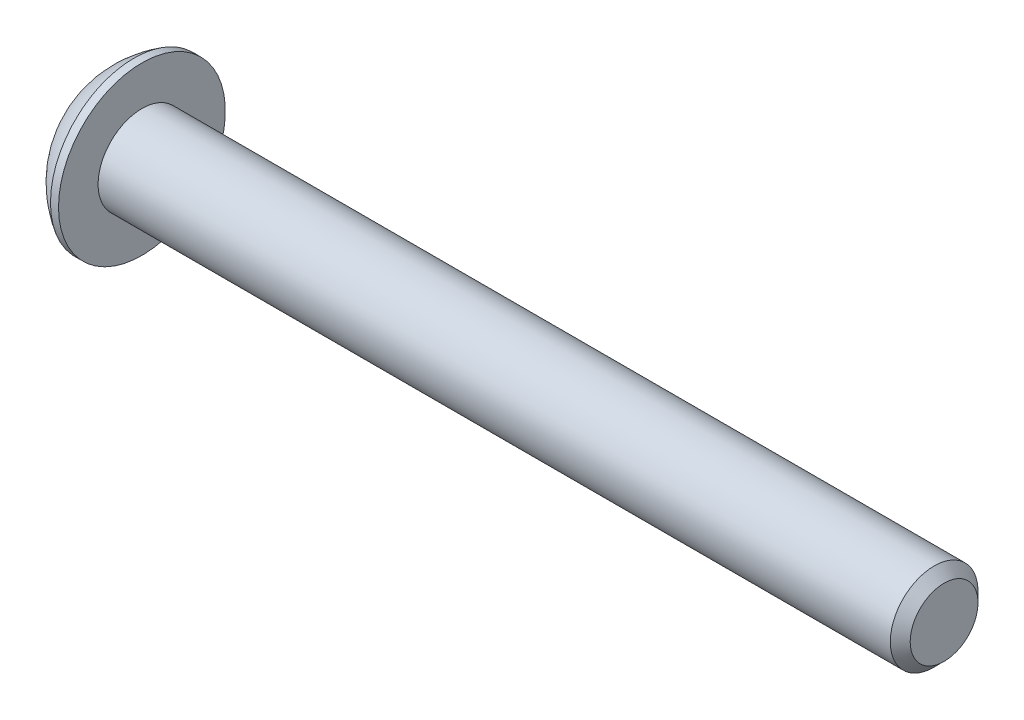
ISO-10303-21;
HEADER;
FILE_DESCRIPTION(('STEP AP214'),'2;1');
FILE_NAME('part.step','',(''),(''),'','','');
FILE_SCHEMA(('AUTOMOTIVE_DESIGN { 1 0 10303 214 1 1 1 1 }'));
ENDSEC;
DATA;
#1=APPLICATION_CONTEXT('core data for automotive mechanical design processes');
#2=APPLICATION_PROTOCOL_DEFINITION('international standard','automotive_design',2000,#1);
#3=PRODUCT_CONTEXT('',#1,'mechanical');
#4=PRODUCT('Part','Part','',(#3));
#5=PRODUCT_RELATED_PRODUCT_CATEGORY('part','',(#4));
#6=PRODUCT_DEFINITION_FORMATION('','',#4);
#7=PRODUCT_DEFINITION_CONTEXT('part definition',#1,'design');
#8=PRODUCT_DEFINITION('design','',#6,#7);
#9=PRODUCT_DEFINITION_SHAPE('','',#8);
#10=(LENGTH_UNIT() NAMED_UNIT(*) SI_UNIT(.MILLI.,.METRE.));
#11=(NAMED_UNIT(*) PLANE_ANGLE_UNIT() SI_UNIT($,.RADIAN.));
#12=(NAMED_UNIT(*) SI_UNIT($,.STERADIAN.) SOLID_ANGLE_UNIT());
#13=UNCERTAINTY_MEASURE_WITH_UNIT(LENGTH_MEASURE(1.E-05),#10,'distance_accuracy_value','');
#14=(GEOMETRIC_REPRESENTATION_CONTEXT(3) GLOBAL_UNCERTAINTY_ASSIGNED_CONTEXT((#13)) GLOBAL_UNIT_ASSIGNED_CONTEXT((#10,
#11,#12)) REPRESENTATION_CONTEXT('',''));
#15=CARTESIAN_POINT('',(0.,0.,0.));
#16=DIRECTION('',(0.,0.,1.));
#17=DIRECTION('',(1.,0.,0.));
#18=AXIS2_PLACEMENT_3D('',#15,#16,#17);
#19=CARTESIAN_POINT('',(1.32080000000034,0.,0.));
#20=DIRECTION('',(-1.,0.,0.));
#21=DIRECTION('',(0.,0.,1.));
#22=AXIS2_PLACEMENT_3D('',#19,#20,#21);
#23=CONICAL_SURFACE('',#22,1.1937999999998,1.04719755119608);
#24=CARTESIAN_POINT('',(2.01004075135902,0.,4.44089209850063E-13));
#25=VERTEX_POINT('',#24);
#26=VERTEX_LOOP('',#25);
#27=FACE_BOUND('',#26,.T.);
#28=CARTESIAN_POINT('',(1.32080000000009,0.,0.));
#29=DIRECTION('',(-1.,0.,0.));
#30=DIRECTION('',(0.,0.,1.));
#31=AXIS2_PLACEMENT_3D('',#28,#29,#30);
#32=CIRCLE('',#31,1.19380000000024);
#33=CARTESIAN_POINT('',(1.32080000000004,-1.03386112703797,0.59690000000006));
#34=VERTEX_POINT('',#33);
#35=CARTESIAN_POINT('',(1.32080000000004,0.,1.19380000000012));
#36=VERTEX_POINT('',#35);
#37=EDGE_CURVE('E19',#34,#36,#32,.T.);
#38=ORIENTED_EDGE('',*,*,#37,.T.);
#39=CARTESIAN_POINT('',(1.32080000000009,0.,0.));
#40=DIRECTION('',(-1.,0.,0.));
#41=DIRECTION('',(0.,0.,1.));
#42=AXIS2_PLACEMENT_3D('',#39,#40,#41);
#43=CIRCLE('',#42,1.19380000000024);
#44=CARTESIAN_POINT('',(1.32080000000004,1.03386112703797,0.596900000000061));
#45=VERTEX_POINT('',#44);
#46=EDGE_CURVE('E148',#36,#45,#43,.T.);
#47=ORIENTED_EDGE('',*,*,#46,.T.);
#48=CARTESIAN_POINT('',(1.32080000000009,0.,0.));
#49=DIRECTION('',(-1.,0.,0.));
#50=DIRECTION('',(0.,0.,1.));
#51=AXIS2_PLACEMENT_3D('',#48,#49,#50);
#52=CIRCLE('',#51,1.19380000000024);
#53=CARTESIAN_POINT('',(1.32080000000004,1.03386112703797,-0.596900000000061));
#54=VERTEX_POINT('',#53);
#55=EDGE_CURVE('E471',#45,#54,#52,.T.);
#56=ORIENTED_EDGE('',*,*,#55,.T.);
#57=CARTESIAN_POINT('',(1.32080000000009,0.,0.));
#58=DIRECTION('',(-1.,0.,0.));
#59=DIRECTION('',(0.,0.,1.));
#60=AXIS2_PLACEMENT_3D('',#57,#58,#59);
#61=CIRCLE('',#60,1.19380000000024);
#62=CARTESIAN_POINT('',(1.32080000000004,1.49457637585666E-12,-1.19380000000012));
#63=VERTEX_POINT('',#62);
#64=EDGE_CURVE('E472',#54,#63,#61,.T.);
#65=ORIENTED_EDGE('',*,*,#64,.T.);
#66=CARTESIAN_POINT('',(1.32080000000009,0.,0.));
#67=DIRECTION('',(-1.,0.,0.));
#68=DIRECTION('',(0.,0.,1.));
#69=AXIS2_PLACEMENT_3D('',#66,#67,#68);
#70=CIRCLE('',#69,1.19380000000024);
#71=CARTESIAN_POINT('',(1.32080000000004,-1.03386112703797,-0.59690000000006));
#72=VERTEX_POINT('',#71);
#73=EDGE_CURVE('E92',#63,#72,#70,.T.);
#74=ORIENTED_EDGE('',*,*,#73,.T.);
#75=CARTESIAN_POINT('',(1.32080000000009,0.,0.));
#76=DIRECTION('',(-1.,0.,0.));
#77=DIRECTION('',(0.,0.,1.));
#78=AXIS2_PLACEMENT_3D('',#75,#76,#77);
#79=CIRCLE('',#78,1.19380000000024);
#80=EDGE_CURVE('E88',#72,#34,#79,.T.);
#81=ORIENTED_EDGE('',*,*,#80,.T.);
#82=EDGE_LOOP('',(#38,#47,#56,#65,#74,#81));
#83=FACE_BOUND('',#82,.T.);
#84=ADVANCED_FACE('F16',(#27,#83),#23,.F.);
#85=CARTESIAN_POINT('',(1.3208,-2.06772225407572,-1.1938));
#86=DIRECTION('',(1.,0.,0.));
#87=DIRECTION('',(0.,0.,-1.));
#88=AXIS2_PLACEMENT_3D('',#85,#86,#87);
#89=PLANE('',#88);
#90=DIRECTION('',(0.,0.5,0.866025403784439));
#91=VECTOR('',#90,1.);
#92=CARTESIAN_POINT('',(1.3208,-1.37848150271715,0.));
#93=LINE('',#92,#91);
#94=CARTESIAN_POINT('',(1.3208,-0.689240751358574,1.1938));
#95=VERTEX_POINT('',#94);
#96=EDGE_CURVE('E100',#95,#34,#93,.F.);
#97=ORIENTED_EDGE('',*,*,#96,.F.);
#98=DIRECTION('',(0.,1.,0.));
#99=VECTOR('',#98,1.);
#100=CARTESIAN_POINT('',(1.3208,-0.689240751358574,1.1938));
#101=LINE('',#100,#99);
#102=EDGE_CURVE('E102',#36,#95,#101,.F.);
#103=ORIENTED_EDGE('',*,*,#102,.F.);
#104=ORIENTED_EDGE('',*,*,#37,.F.);
#105=EDGE_LOOP('',(#97,#103,#104));
#106=FACE_BOUND('',#105,.T.);
#107=ADVANCED_FACE('F98',(#106),#89,.F.);
#108=CARTESIAN_POINT('',(1.3208,-2.06772225407572,-1.1938));
#109=DIRECTION('',(1.,0.,0.));
#110=DIRECTION('',(0.,0.,-1.));
#111=AXIS2_PLACEMENT_3D('',#108,#109,#110);
#112=PLANE('',#111);
#113=DIRECTION('',(0.,-0.5,0.866025403784439));
#114=VECTOR('',#113,1.);
#115=CARTESIAN_POINT('',(1.3208,-0.689240751358574,-1.1938));
#116=LINE('',#115,#114);
#117=CARTESIAN_POINT('',(1.3208,-1.37848150271715,0.));
#118=VERTEX_POINT('',#117);
#119=EDGE_CURVE('E108',#118,#72,#116,.F.);
#120=ORIENTED_EDGE('',*,*,#119,.F.);
#121=DIRECTION('',(0.,0.5,0.866025403784439));
#122=VECTOR('',#121,1.);
#123=CARTESIAN_POINT('',(1.3208,-1.37848150271715,0.));
#124=LINE('',#123,#122);
#125=EDGE_CURVE('E105',#34,#118,#124,.F.);
#126=ORIENTED_EDGE('',*,*,#125,.F.);
#127=ORIENTED_EDGE('',*,*,#80,.F.);
#128=EDGE_LOOP('',(#120,#126,#127));
#129=FACE_BOUND('',#128,.T.);
#130=ADVANCED_FACE('F106',(#129),#112,.F.);
#131=CARTESIAN_POINT('',(1.3208,-2.06772225407572,-1.1938));
#132=DIRECTION('',(1.,0.,0.));
#133=DIRECTION('',(0.,0.,-1.));
#134=AXIS2_PLACEMENT_3D('',#131,#132,#133);
#135=PLANE('',#134);
#136=DIRECTION('',(0.,1.,0.));
#137=VECTOR('',#136,1.);
#138=CARTESIAN_POINT('',(1.3208,0.689240751358577,-1.1938));
#139=LINE('',#138,#137);
#140=CARTESIAN_POINT('',(1.3208,-0.689240751358574,-1.1938));
#141=VERTEX_POINT('',#140);
#142=EDGE_CURVE('E442',#141,#63,#139,.T.);
#143=ORIENTED_EDGE('',*,*,#142,.F.);
#144=DIRECTION('',(0.,-0.5,0.866025403784439));
#145=VECTOR('',#144,1.);
#146=CARTESIAN_POINT('',(1.3208,-0.689240751358574,-1.1938));
#147=LINE('',#146,#145);
#148=EDGE_CURVE('E454',#72,#141,#147,.F.);
#149=ORIENTED_EDGE('',*,*,#148,.F.);
#150=ORIENTED_EDGE('',*,*,#73,.F.);
#151=EDGE_LOOP('',(#143,#149,#150));
#152=FACE_BOUND('',#151,.T.);
#153=ADVANCED_FACE('F191',(#152),#135,.F.);
#154=CARTESIAN_POINT('',(1.3208,-2.06772225407572,-1.1938));
#155=DIRECTION('',(1.,0.,0.));
#156=DIRECTION('',(0.,0.,-1.));
#157=AXIS2_PLACEMENT_3D('',#154,#155,#156);
#158=PLANE('',#157);
#159=DIRECTION('',(0.,-0.5,-0.866025403784439));
#160=VECTOR('',#159,1.);
#161=CARTESIAN_POINT('',(1.3208,1.37848150271715,0.));
#162=LINE('',#161,#160);
#163=CARTESIAN_POINT('',(1.3208,0.689240751358577,-1.1938));
#164=VERTEX_POINT('',#163);
#165=EDGE_CURVE('E428',#164,#54,#162,.F.);
#166=ORIENTED_EDGE('',*,*,#165,.F.);
#167=DIRECTION('',(0.,1.,0.));
#168=VECTOR('',#167,1.);
#169=CARTESIAN_POINT('',(1.3208,0.689240751358577,-1.1938));
#170=LINE('',#169,#168);
#171=EDGE_CURVE('E439',#63,#164,#170,.T.);
#172=ORIENTED_EDGE('',*,*,#171,.F.);
#173=ORIENTED_EDGE('',*,*,#64,.F.);
#174=EDGE_LOOP('',(#166,#172,#173));
#175=FACE_BOUND('',#174,.T.);
#176=ADVANCED_FACE('F187',(#175),#158,.F.);
#177=CARTESIAN_POINT('',(1.3208,-2.06772225407572,-1.1938));
#178=DIRECTION('',(1.,0.,0.));
#179=DIRECTION('',(0.,0.,-1.));
#180=AXIS2_PLACEMENT_3D('',#177,#178,#179);
#181=PLANE('',#180);
#182=DIRECTION('',(0.,0.5,-0.866025403784439));
#183=VECTOR('',#182,1.);
#184=CARTESIAN_POINT('',(1.3208,0.689240751358576,1.1938));
#185=LINE('',#184,#183);
#186=CARTESIAN_POINT('',(1.3208,1.37848150271715,0.));
#187=VERTEX_POINT('',#186);
#188=EDGE_CURVE('E407',#187,#45,#185,.F.);
#189=ORIENTED_EDGE('',*,*,#188,.F.);
#190=DIRECTION('',(0.,-0.5,-0.866025403784439));
#191=VECTOR('',#190,1.);
#192=CARTESIAN_POINT('',(1.3208,1.37848150271715,0.));
#193=LINE('',#192,#191);
#194=EDGE_CURVE('E426',#54,#187,#193,.F.);
#195=ORIENTED_EDGE('',*,*,#194,.F.);
#196=ORIENTED_EDGE('',*,*,#55,.F.);
#197=EDGE_LOOP('',(#189,#195,#196));
#198=FACE_BOUND('',#197,.T.);
#199=ADVANCED_FACE('F183',(#198),#181,.F.);
#200=CARTESIAN_POINT('',(1.3208,-2.06772225407572,-1.1938));
#201=DIRECTION('',(1.,0.,0.));
#202=DIRECTION('',(0.,0.,-1.));
#203=AXIS2_PLACEMENT_3D('',#200,#201,#202);
#204=PLANE('',#203);
#205=DIRECTION('',(0.,1.,0.));
#206=VECTOR('',#205,1.);
#207=CARTESIAN_POINT('',(1.3208,-0.689240751358574,1.1938));
#208=LINE('',#207,#206);
#209=CARTESIAN_POINT('',(1.3208,0.689240751358576,1.1938));
#210=VERTEX_POINT('',#209);
#211=EDGE_CURVE('E117',#210,#36,#208,.F.);
#212=ORIENTED_EDGE('',*,*,#211,.F.);
#213=DIRECTION('',(0.,0.5,-0.866025403784439));
#214=VECTOR('',#213,1.);
#215=CARTESIAN_POINT('',(1.3208,0.689240751358576,1.1938));
#216=LINE('',#215,#214);
#217=EDGE_CURVE('E410',#45,#210,#216,.F.);
#218=ORIENTED_EDGE('',*,*,#217,.F.);
#219=ORIENTED_EDGE('',*,*,#46,.F.);
#220=EDGE_LOOP('',(#212,#218,#219));
#221=FACE_BOUND('',#220,.T.);
#222=ADVANCED_FACE('F179',(#221),#204,.F.);
#223=CARTESIAN_POINT('',(1.3208,-0.689240751358574,1.1938));
#224=DIRECTION('',(0.,0.,-1.));
#225=DIRECTION('',(0.,1.,0.));
#226=AXIS2_PLACEMENT_3D('',#223,#224,#225);
#227=PLANE('',#226);
#228=DIRECTION('',(0.,1.,0.));
#229=VECTOR('',#228,1.);
#230=CARTESIAN_POINT('',(0.,0.,1.1938));
#231=LINE('',#230,#229);
#232=CARTESIAN_POINT('',(0.,0.689240751358577,1.1938));
#233=VERTEX_POINT('',#232);
#234=CARTESIAN_POINT('',(0.,-0.689240751358574,1.1938));
#235=VERTEX_POINT('',#234);
#236=EDGE_CURVE('E404',#233,#235,#231,.F.);
#237=ORIENTED_EDGE('',*,*,#236,.F.);
#238=DIRECTION('',(1.,0.,0.));
#239=VECTOR('',#238,1.);
#240=CARTESIAN_POINT('',(1.3208,0.689240751358576,1.1938));
#241=LINE('',#240,#239);
#242=EDGE_CURVE('E416',#210,#233,#241,.F.);
#243=ORIENTED_EDGE('',*,*,#242,.F.);
#244=ORIENTED_EDGE('',*,*,#211,.T.);
#245=ORIENTED_EDGE('',*,*,#102,.T.);
#246=DIRECTION('',(1.,0.,0.));
#247=VECTOR('',#246,1.);
#248=CARTESIAN_POINT('',(1.3208,-0.689240751358574,1.1938));
#249=LINE('',#248,#247);
#250=EDGE_CURVE('E111',#235,#95,#249,.T.);
#251=ORIENTED_EDGE('',*,*,#250,.F.);
#252=EDGE_LOOP('',(#237,#243,#244,#245,#251));
#253=FACE_BOUND('',#252,.T.);
#254=ADVANCED_FACE('F176',(#253),#227,.T.);
#255=CARTESIAN_POINT('',(1.3208,-1.37848150271715,0.));
#256=DIRECTION('',(0.,0.866025403784439,-0.5));
#257=DIRECTION('',(0.,0.5,0.866025403784439));
#258=AXIS2_PLACEMENT_3D('',#255,#256,#257);
#259=PLANE('',#258);
#260=DIRECTION('',(0.,-0.5,-0.866025403784439));
#261=VECTOR('',#260,1.);
#262=CARTESIAN_POINT('',(0.,-0.689240751358574,1.1938));
#263=LINE('',#262,#261);
#264=CARTESIAN_POINT('',(0.,-1.37848150271715,0.));
#265=VERTEX_POINT('',#264);
#266=EDGE_CURVE('E401',#235,#265,#263,.T.);
#267=ORIENTED_EDGE('',*,*,#266,.F.);
#268=ORIENTED_EDGE('',*,*,#250,.T.);
#269=ORIENTED_EDGE('',*,*,#96,.T.);
#270=ORIENTED_EDGE('',*,*,#125,.T.);
#271=DIRECTION('',(1.,0.,0.));
#272=VECTOR('',#271,1.);
#273=CARTESIAN_POINT('',(1.3208,-1.37848150271715,0.));
#274=LINE('',#273,#272);
#275=EDGE_CURVE('E451',#265,#118,#274,.T.);
#276=ORIENTED_EDGE('',*,*,#275,.F.);
#277=EDGE_LOOP('',(#267,#268,#269,#270,#276));
#278=FACE_BOUND('',#277,.T.);
#279=ADVANCED_FACE('F115',(#278),#259,.T.);
#280=CARTESIAN_POINT('',(1.3208,-0.689240751358574,-1.1938));
#281=DIRECTION('',(0.,0.866025403784439,0.5));
#282=DIRECTION('',(0.,-0.5,0.866025403784439));
#283=AXIS2_PLACEMENT_3D('',#280,#281,#282);
#284=PLANE('',#283);
#285=DIRECTION('',(0.,0.5,-0.866025403784439));
#286=VECTOR('',#285,1.);
#287=CARTESIAN_POINT('',(0.,-1.37848150271715,0.));
#288=LINE('',#287,#286);
#289=CARTESIAN_POINT('',(0.,-0.689240751358574,-1.1938));
#290=VERTEX_POINT('',#289);
#291=EDGE_CURVE('E398',#265,#290,#288,.T.);
#292=ORIENTED_EDGE('',*,*,#291,.F.);
#293=ORIENTED_EDGE('',*,*,#275,.T.);
#294=ORIENTED_EDGE('',*,*,#119,.T.);
#295=ORIENTED_EDGE('',*,*,#148,.T.);
#296=DIRECTION('',(1.,0.,0.));
#297=VECTOR('',#296,1.);
#298=CARTESIAN_POINT('',(1.3208,-0.689240751358574,-1.1938));
#299=LINE('',#298,#297);
#300=EDGE_CURVE('E436',#290,#141,#299,.T.);
#301=ORIENTED_EDGE('',*,*,#300,.F.);
#302=EDGE_LOOP('',(#292,#293,#294,#295,#301));
#303=FACE_BOUND('',#302,.T.);
#304=ADVANCED_FACE('F169',(#303),#284,.T.);
#305=CARTESIAN_POINT('',(1.3208,0.689240751358577,-1.1938));
#306=DIRECTION('',(0.,0.,1.));
#307=DIRECTION('',(1.,0.,0.));
#308=AXIS2_PLACEMENT_3D('',#305,#306,#307);
#309=PLANE('',#308);
#310=DIRECTION('',(0.,1.,0.));
#311=VECTOR('',#310,1.);
#312=CARTESIAN_POINT('',(0.,0.,-1.1938));
#313=LINE('',#312,#311);
#314=CARTESIAN_POINT('',(0.,0.689240751358577,-1.1938));
#315=VERTEX_POINT('',#314);
#316=EDGE_CURVE('E395',#290,#315,#313,.T.);
#317=ORIENTED_EDGE('',*,*,#316,.F.);
#318=ORIENTED_EDGE('',*,*,#300,.T.);
#319=ORIENTED_EDGE('',*,*,#142,.T.);
#320=ORIENTED_EDGE('',*,*,#171,.T.);
#321=DIRECTION('',(1.,0.,0.));
#322=VECTOR('',#321,1.);
#323=CARTESIAN_POINT('',(1.3208,0.689240751358577,-1.1938));
#324=LINE('',#323,#322);
#325=EDGE_CURVE('E411',#315,#164,#324,.T.);
#326=ORIENTED_EDGE('',*,*,#325,.F.);
#327=EDGE_LOOP('',(#317,#318,#319,#320,#326));
#328=FACE_BOUND('',#327,.T.);
#329=ADVANCED_FACE('F166',(#328),#309,.T.);
#330=CARTESIAN_POINT('',(1.3208,1.37848150271715,0.));
#331=DIRECTION('',(0.,-0.866025403784439,0.5));
#332=DIRECTION('',(0.,-0.5,-0.866025403784439));
#333=AXIS2_PLACEMENT_3D('',#330,#331,#332);
#334=PLANE('',#333);
#335=DIRECTION('',(0.,0.5,0.866025403784439));
#336=VECTOR('',#335,1.);
#337=CARTESIAN_POINT('',(0.,0.689240751358577,-1.1938));
#338=LINE('',#337,#336);
#339=CARTESIAN_POINT('',(0.,1.37848150271715,0.));
#340=VERTEX_POINT('',#339);
#341=EDGE_CURVE('E392',#315,#340,#338,.T.);
#342=ORIENTED_EDGE('',*,*,#341,.F.);
#343=ORIENTED_EDGE('',*,*,#325,.T.);
#344=ORIENTED_EDGE('',*,*,#165,.T.);
#345=ORIENTED_EDGE('',*,*,#194,.T.);
#346=DIRECTION('',(1.,0.,0.));
#347=VECTOR('',#346,1.);
#348=CARTESIAN_POINT('',(1.3208,1.37848150271715,0.));
#349=LINE('',#348,#347);
#350=EDGE_CURVE('E34',#340,#187,#349,.T.);
#351=ORIENTED_EDGE('',*,*,#350,.F.);
#352=EDGE_LOOP('',(#342,#343,#344,#345,#351));
#353=FACE_BOUND('',#352,.T.);
#354=ADVANCED_FACE('F162',(#353),#334,.T.);
#355=CARTESIAN_POINT('',(1.3208,0.689240751358576,1.1938));
#356=DIRECTION('',(0.,-0.866025403784439,-0.5));
#357=DIRECTION('',(0.,0.5,-0.866025403784439));
#358=AXIS2_PLACEMENT_3D('',#355,#356,#357);
#359=PLANE('',#358);
#360=DIRECTION('',(0.,-0.5,0.866025403784439));
#361=VECTOR('',#360,1.);
#362=CARTESIAN_POINT('',(0.,1.37848150271715,0.));
#363=LINE('',#362,#361);
#364=EDGE_CURVE('E147',#340,#233,#363,.T.);
#365=ORIENTED_EDGE('',*,*,#364,.F.);
#366=ORIENTED_EDGE('',*,*,#350,.T.);
#367=ORIENTED_EDGE('',*,*,#188,.T.);
#368=ORIENTED_EDGE('',*,*,#217,.T.);
#369=ORIENTED_EDGE('',*,*,#242,.T.);
#370=EDGE_LOOP('',(#365,#366,#367,#368,#369));
#371=FACE_BOUND('',#370,.T.);
#372=ADVANCED_FACE('F158',(#371),#359,.T.);
#373=CARTESIAN_POINT('',(0.,0.,0.));
#374=DIRECTION('',(-1.,0.,0.));
#375=DIRECTION('',(0.,0.,1.));
#376=AXIS2_PLACEMENT_3D('',#373,#374,#375);
#377=PLANE('',#376);
#378=ORIENTED_EDGE('',*,*,#341,.T.);
#379=ORIENTED_EDGE('',*,*,#364,.T.);
#380=ORIENTED_EDGE('',*,*,#236,.T.);
#381=ORIENTED_EDGE('',*,*,#266,.T.);
#382=ORIENTED_EDGE('',*,*,#291,.T.);
#383=ORIENTED_EDGE('',*,*,#316,.T.);
#384=EDGE_LOOP('',(#378,#379,#380,#381,#382,#383));
#385=FACE_BOUND('',#384,.T.);
#386=CARTESIAN_POINT('',(0.,1.9812,0.));
#387=CARTESIAN_POINT('',(0.,1.9811996664299,0.0556258831179428));
#388=CARTESIAN_POINT('',(0.,1.97885520380442,0.111261989398606));
#389=CARTESIAN_POINT('',(0.,1.96949260169541,0.222149719830458));
#390=CARTESIAN_POINT('',(0.,1.96247308239605,0.277401225602895));
#391=CARTESIAN_POINT('',(0.,1.94379192841038,0.387209508139747));
#392=CARTESIAN_POINT('',(-1.85325793235264E-13,1.93212292489526,0.441765039546365));
#393=CARTESIAN_POINT('',(1.86344214223505E-13,1.90422331175315,0.549729449347493));
#394=CARTESIAN_POINT('',(6.94543371897454E-13,1.88798900035338,0.603137359208869));
#395=CARTESIAN_POINT('',(1.15501975216981E-12,1.83266214476501,0.760839131321828));
#396=CARTESIAN_POINT('',(0.,1.78690023648845,0.862876433575429));
#397=CARTESIAN_POINT('',(0.,1.67887358150667,1.05780719540872));
#398=CARTESIAN_POINT('',(9.54193214892627E-13,1.6166082074585,1.15070030720801));
#399=CARTESIAN_POINT('',(5.94805591894675E-13,1.51224157140982,1.28116890915697));
#400=CARTESIAN_POINT('',(1.63221293851378E-13,1.4755970394354,1.32320451127026));
#401=CARTESIAN_POINT('',(-1.62196980336157E-13,1.39893832619713,1.40400288695709));
#402=CARTESIAN_POINT('',(0.,1.35892742784698,1.44276877695455));
#403=CARTESIAN_POINT('',(1.14362537325405E-13,1.23416504602197,1.55382272417904));
#404=CARTESIAN_POINT('',(0.,1.14466125559859,1.62089527952111));
#405=CARTESIAN_POINT('',(0.,0.955712144178167,1.7390221808118));
#406=CARTESIAN_POINT('',(0.,0.856267198233564,1.79007713076007));
#407=CARTESIAN_POINT('',(0.,0.650206345910843,1.87477637530954));
#408=CARTESIAN_POINT('',(0.,0.543590516134855,1.90842085586267));
#409=CARTESIAN_POINT('',(0.,0.326226155292018,1.95733039300656));
#410=CARTESIAN_POINT('',(0.,0.21547760215793,1.97259535144288));
#411=CARTESIAN_POINT('',(0.,-0.00701040587544639,1.98431697865418));
#412=CARTESIAN_POINT('',(0.,-0.118749860774734,1.98077364742917));
#413=CARTESIAN_POINT('',(0.,-0.340050178355485,1.95497485623825));
#414=CARTESIAN_POINT('',(0.,-0.449611052668255,1.93271949620218));
#415=CARTESIAN_POINT('',(0.,-0.663431110729174,1.87014138774523));
#416=CARTESIAN_POINT('',(0.,-0.76769023783852,1.82981844635272));
#417=CARTESIAN_POINT('',(0.,-0.968005760719347,1.73219968377096));
#418=CARTESIAN_POINT('',(0.,-1.0640618469811,1.6749032225164));
#419=CARTESIAN_POINT('',(0.,-1.19980276751283,1.57757371205873));
#420=CARTESIAN_POINT('',(0.,-1.24366557129213,1.54322665019466));
#421=CARTESIAN_POINT('',(0.,-1.32838995706696,1.47093063174264));
#422=CARTESIAN_POINT('',(0.,-1.36924860178706,1.43297823102439));
#423=CARTESIAN_POINT('',(0.,-1.48674671849223,1.31419842051173));
#424=CARTESIAN_POINT('',(0.,-1.55842832343237,1.22836221289311));
#425=CARTESIAN_POINT('',(0.,-1.6863396856475,1.04586168272493));
#426=CARTESIAN_POINT('',(0.,-1.7425700302488,0.949197771949774));
#427=CARTESIAN_POINT('',(0.,-1.8141614250401,0.798182600298684));
#428=CARTESIAN_POINT('',(0.,-1.83591780585875,0.746776203847791));
#429=CARTESIAN_POINT('',(0.,-1.87500754181092,0.642341081688636));
#430=CARTESIAN_POINT('',(0.,-1.89234447645404,0.589313708122847));
#431=CARTESIAN_POINT('',(0.,-1.92246053433554,0.482076273028395));
#432=CARTESIAN_POINT('',(0.,-1.93524685475118,0.42786822425751));
#433=CARTESIAN_POINT('',(0.,-1.95620937250494,0.318578151844611));
#434=CARTESIAN_POINT('',(0.,-1.96438692958147,0.263496390912872));
#435=CARTESIAN_POINT('',(0.,-1.97388528284653,0.173607715038558));
#436=CARTESIAN_POINT('',(0.,-1.97662743364426,0.138944718024998));
#437=CARTESIAN_POINT('',(0.,-1.98028489645283,0.0695224782567002));
#438=CARTESIAN_POINT('',(0.,-1.98120020846367,0.0347632355019631));
#439=CARTESIAN_POINT('',(0.,-1.9811996664299,-0.0556258831179437));
#440=CARTESIAN_POINT('',(0.,-1.97885520380442,-0.111261989398607));
#441=CARTESIAN_POINT('',(0.,-1.96949260169541,-0.222149719830459));
#442=CARTESIAN_POINT('',(0.,-1.96247308239605,-0.277401225602897));
#443=CARTESIAN_POINT('',(0.,-1.94379192841039,-0.387209508139749));
#444=CARTESIAN_POINT('',(-1.85269749640691E-13,-1.93212292489526,-0.441765039546367));
#445=CARTESIAN_POINT('',(1.86288125054388E-13,-1.90422331175315,-0.549729449347495));
#446=CARTESIAN_POINT('',(6.94525090263764E-13,-1.88798900035338,-0.603137359208872));
#447=CARTESIAN_POINT('',(1.15505622829081E-12,-1.83266214476501,-0.760839131321831));
#448=CARTESIAN_POINT('',(0.,-1.78690023648845,-0.862876433575431));
#449=CARTESIAN_POINT('',(0.,-1.67887358150667,-1.05780719540872));
#450=CARTESIAN_POINT('',(9.54248812869379E-13,-1.6166082074585,-1.15070030720801));
#451=CARTESIAN_POINT('',(5.94777756479239E-13,-1.51224157140982,-1.28116890915698));
#452=CARTESIAN_POINT('',(1.63138949183833E-13,-1.47559703943539,-1.32320451127027));
#453=CARTESIAN_POINT('',(-1.62114715061273E-13,-1.39893832619713,-1.40400288695709));
#454=CARTESIAN_POINT('',(0.,-1.35892742784699,-1.44276877695455));
#455=CARTESIAN_POINT('',(1.13760489124207E-13,-1.23416504602197,-1.55382272417904));
#456=CARTESIAN_POINT('',(0.,-1.14466125559859,-1.62089527952111));
#457=CARTESIAN_POINT('',(0.,-0.95571214417816,-1.73902218081179));
#458=CARTESIAN_POINT('',(0.,-0.856267198233559,-1.79007713076007));
#459=CARTESIAN_POINT('',(0.,-0.650206345910841,-1.87477637530954));
#460=CARTESIAN_POINT('',(0.,-0.543590516134854,-1.90842085586267));
#461=CARTESIAN_POINT('',(0.,-0.326226155292018,-1.95733039300657));
#462=CARTESIAN_POINT('',(0.,-0.215477602157929,-1.97259535144288));
#463=CARTESIAN_POINT('',(0.,0.0070104058754487,-1.98431697865418));
#464=CARTESIAN_POINT('',(0.,0.118749860774737,-1.98077364742916));
#465=CARTESIAN_POINT('',(0.,0.340050178355489,-1.95497485623824));
#466=CARTESIAN_POINT('',(0.,0.44961105266826,-1.93271949620218));
#467=CARTESIAN_POINT('',(0.,0.663431110729178,-1.87014138774524));
#468=CARTESIAN_POINT('',(0.,0.767690237838524,-1.82981844635272));
#469=CARTESIAN_POINT('',(0.,0.968005760719348,-1.73219968377096));
#470=CARTESIAN_POINT('',(0.,1.0640618469811,-1.67490322251639));
#471=CARTESIAN_POINT('',(0.,1.19980276751283,-1.57757371205873));
#472=CARTESIAN_POINT('',(0.,1.24366557129214,-1.54322665019465));
#473=CARTESIAN_POINT('',(0.,1.32838995706696,-1.47093063174263));
#474=CARTESIAN_POINT('',(0.,1.36924860178706,-1.43297823102439));
#475=CARTESIAN_POINT('',(0.,1.48674671849223,-1.31419842051172));
#476=CARTESIAN_POINT('',(0.,1.55842832343237,-1.22836221289311));
#477=CARTESIAN_POINT('',(0.,1.6863396856475,-1.04586168272492));
#478=CARTESIAN_POINT('',(0.,1.7425700302488,-0.949197771949768));
#479=CARTESIAN_POINT('',(0.,1.8141614250401,-0.798182600298677));
#480=CARTESIAN_POINT('',(0.,1.83591780585875,-0.746776203847785));
#481=CARTESIAN_POINT('',(0.,1.87500754181092,-0.64234108168863));
#482=CARTESIAN_POINT('',(0.,1.89234447645404,-0.589313708122841));
#483=CARTESIAN_POINT('',(0.,1.92246053433555,-0.482076273028389));
#484=CARTESIAN_POINT('',(0.,1.93524685475118,-0.427868224257505));
#485=CARTESIAN_POINT('',(0.,1.95620937250494,-0.318578151844605));
#486=CARTESIAN_POINT('',(0.,1.96438692958147,-0.263496390912866));
#487=CARTESIAN_POINT('',(0.,1.97388528284653,-0.173607715038553));
#488=CARTESIAN_POINT('',(0.,1.97662743364426,-0.138944718024994));
#489=CARTESIAN_POINT('',(0.,1.98028489645283,-0.0695224782566989));
#490=CARTESIAN_POINT('',(0.,1.98120020846367,-0.034763235501963));
#491=CARTESIAN_POINT('',(0.,1.9812,0.));
#492=B_SPLINE_CURVE_WITH_KNOTS('',3,(#386,#387,#388,#389,#390,#391,#392,#393,#394,#395,#396,
#397,#398,#399,#400,#401,#402,#403,#404,#405,#406,#407,#408,#409,#410,#411,#412,#413,#414,#415,
#416,#417,#418,#419,#420,#421,#422,#423,#424,#425,#426,#427,#428,#429,#430,#431,#432,#433,#434,
#435,#436,#437,#438,#439,#440,#441,#442,#443,#444,#445,#446,#447,#448,#449,#450,#451,#452,#453,
#454,#455,#456,#457,#458,#459,#460,#461,#462,#463,#464,#465,#466,#467,#468,#469,#470,#471,#472,
#473,#474,#475,#476,#477,#478,#479,#480,#481,#482,#483,#484,#485,#486,#487,#488,#489,#490,#491),
.UNSPECIFIED.,.T.,.F.,(4,2,2,2,2,2,2,2,2,2,2,2,2,2,2,2,2,2,2,2,2,2,2,2,2,2,2,2,2,2,2,2,2,2,2,2,
2,2,2,2,2,2,2,2,2,2,2,2,2,2,2,2,4),(0.,0.166845646007828,0.333740557374255,0.500901034367693,
0.668197445942386,1.00199278686282,1.33580081809885,1.50292354032982,1.6698851310853,
2.00370118900129,2.33750465770544,2.67130456115909,3.005106247238,3.33890793331696,
3.67270783677065,4.00651130547476,4.34032736339026,4.50728895414554,4.67441167637632,
5.00821970761259,5.34201504853332,5.50931146010827,5.67647193710191,5.84336684846844,
6.0102124944764,6.11448220058334,6.21875190669029,6.38559755269812,6.55249246406454,
6.71965294105798,6.88694935263268,7.22074469355311,7.55455272478915,7.72167544702011,
7.88863703777559,8.22245309569158,8.55625656439573,8.89005646784938,9.2238581539283,
9.55765984000725,9.89145974346094,10.2252632121651,10.5590792700806,10.7260408608358,
10.8931635830666,11.2269716143029,11.5607669552236,11.7280633667986,11.8952238437922,
12.0621187551587,12.2289644011667,12.3332341072736,12.4375038133806),.UNSPECIFIED.);
#493=CARTESIAN_POINT('',(0.,1.9812,0.));
#494=VERTEX_POINT('',#493);
#495=EDGE_CURVE('E139',#494,#494,#492,.T.);
#496=ORIENTED_EDGE('',*,*,#495,.F.);
#497=EDGE_LOOP('',(#496));
#498=FACE_BOUND('',#497,.T.);
#499=ADVANCED_FACE('F154',(#385,#498),#377,.T.);
#500=CARTESIAN_POINT('',(4.13385,0.,0.));
#501=DIRECTION('',(0.,1.,0.));
#502=DIRECTION('',(1.,0.,0.));
#503=AXIS2_PLACEMENT_3D('',#500,#501,#502);
#504=SPHERICAL_SURFACE('',#503,4.58408870578439);
#505=CARTESIAN_POINT('',(1.8288,0.,0.));
#506=DIRECTION('',(-1.,0.,0.));
#507=DIRECTION('',(0.,0.,1.));
#508=AXIS2_PLACEMENT_3D('',#505,#506,#507);
#509=CIRCLE('',#508,3.9624);
#510=CARTESIAN_POINT('',(1.8288,0.,3.9624));
#511=VERTEX_POINT('',#510);
#512=EDGE_CURVE('E136',#511,#511,#509,.F.);
#513=ORIENTED_EDGE('',*,*,#512,.F.);
#514=EDGE_LOOP('',(#513));
#515=FACE_BOUND('',#514,.T.);
#516=ORIENTED_EDGE('',*,*,#495,.T.);
#517=EDGE_LOOP('',(#516));
#518=FACE_BOUND('',#517,.T.);
#519=ADVANCED_FACE('F150',(#515,#518),#504,.T.);
#520=CARTESIAN_POINT('',(40.3098,0.,0.));
#521=DIRECTION('',(-1.,0.,0.));
#522=DIRECTION('',(0.,0.,1.));
#523=AXIS2_PLACEMENT_3D('',#520,#521,#522);
#524=PLANE('',#523);
#525=CARTESIAN_POINT('',(40.3097999999886,0.,0.));
#526=DIRECTION('',(-1.,0.,0.));
#527=DIRECTION('',(0.,0.,1.));
#528=AXIS2_PLACEMENT_3D('',#525,#526,#527);
#529=CIRCLE('',#528,1.61036000002923);
#530=CARTESIAN_POINT('',(40.3097999999886,0.,1.61036000002923));
#531=VERTEX_POINT('',#530);
#532=EDGE_CURVE('E133',#531,#531,#529,.T.);
#533=ORIENTED_EDGE('',*,*,#532,.F.);
#534=EDGE_LOOP('',(#533));
#535=FACE_BOUND('',#534,.T.);
#536=ADVANCED_FACE('F221',(#535),#524,.F.);
#537=CARTESIAN_POINT('',(0.,0.,0.));
#538=DIRECTION('',(-1.,0.,0.));
#539=DIRECTION('',(0.,0.,1.));
#540=AXIS2_PLACEMENT_3D('',#537,#538,#539);
#541=CYLINDRICAL_SURFACE('',#540,3.9624);
#542=ORIENTED_EDGE('',*,*,#512,.T.);
#543=EDGE_LOOP('',(#542));
#544=FACE_BOUND('',#543,.T.);
#545=CARTESIAN_POINT('',(2.2098,0.,0.));
#546=DIRECTION('',(-1.,0.,0.));
#547=DIRECTION('',(0.,0.,1.));
#548=AXIS2_PLACEMENT_3D('',#545,#546,#547);
#549=CIRCLE('',#548,3.9624);
#550=CARTESIAN_POINT('',(2.2098,0.,3.9624));
#551=VERTEX_POINT('',#550);
#552=EDGE_CURVE('E130',#551,#551,#549,.T.);
#553=ORIENTED_EDGE('',*,*,#552,.T.);
#554=EDGE_LOOP('',(#553));
#555=FACE_BOUND('',#554,.T.);
#556=ADVANCED_FACE('F218',(#544,#555),#541,.T.);
#557=CARTESIAN_POINT('',(39.8373600000923,0.,0.));
#558=DIRECTION('',(-1.,0.,0.));
#559=DIRECTION('',(0.,0.,1.));
#560=AXIS2_PLACEMENT_3D('',#557,#558,#559);
#561=CONICAL_SURFACE('',#560,2.08279999992556,0.785398163397448);
#562=CARTESIAN_POINT('',(39.83736,0.,0.));
#563=DIRECTION('',(-1.,0.,0.));
#564=DIRECTION('',(0.,0.,1.));
#565=AXIS2_PLACEMENT_3D('',#562,#563,#564);
#566=CIRCLE('',#565,2.0828);
#567=CARTESIAN_POINT('',(39.83736,0.,2.0828));
#568=VERTEX_POINT('',#567);
#569=EDGE_CURVE('E25',#568,#568,#566,.T.);
#570=ORIENTED_EDGE('',*,*,#569,.F.);
#571=EDGE_LOOP('',(#570));
#572=FACE_BOUND('',#571,.T.);
#573=ORIENTED_EDGE('',*,*,#532,.T.);
#574=EDGE_LOOP('',(#573));
#575=FACE_BOUND('',#574,.T.);
#576=ADVANCED_FACE('F211',(#572,#575),#561,.T.);
#577=CARTESIAN_POINT('',(2.2098,2.0828,0.));
#578=DIRECTION('',(-1.,0.,0.));
#579=DIRECTION('',(0.,0.,1.));
#580=AXIS2_PLACEMENT_3D('',#577,#578,#579);
#581=PLANE('',#580);
#582=CARTESIAN_POINT('',(2.2098,0.,0.));
#583=DIRECTION('',(-1.,0.,0.));
#584=DIRECTION('',(0.,0.,1.));
#585=AXIS2_PLACEMENT_3D('',#582,#583,#584);
#586=CIRCLE('',#585,2.0828);
#587=CARTESIAN_POINT('',(2.2098,0.,2.0828));
#588=VERTEX_POINT('',#587);
#589=EDGE_CURVE('E11',#588,#588,#586,.F.);
#590=ORIENTED_EDGE('',*,*,#589,.F.);
#591=EDGE_LOOP('',(#590));
#592=FACE_BOUND('',#591,.T.);
#593=ORIENTED_EDGE('',*,*,#552,.F.);
#594=EDGE_LOOP('',(#593));
#595=FACE_BOUND('',#594,.T.);
#596=ADVANCED_FACE('F205',(#592,#595),#581,.F.);
#597=CARTESIAN_POINT('',(0.,0.,0.));
#598=DIRECTION('',(-1.,0.,0.));
#599=DIRECTION('',(0.,0.,1.));
#600=AXIS2_PLACEMENT_3D('',#597,#598,#599);
#601=CYLINDRICAL_SURFACE('',#600,2.0828);
#602=ORIENTED_EDGE('',*,*,#589,.T.);
#603=EDGE_LOOP('',(#602));
#604=FACE_BOUND('',#603,.T.);
#605=ORIENTED_EDGE('',*,*,#569,.T.);
#606=EDGE_LOOP('',(#605));
#607=FACE_BOUND('',#606,.T.);
#608=ADVANCED_FACE('F203',(#604,#607),#601,.T.);
#609=CLOSED_SHELL('',(#84,#107,#130,#153,#176,#199,#222,#254,#279,#304,#329,#354,#372,#499,#519,
#536,#556,#576,#596,#608));
#610=MANIFOLD_SOLID_BREP('B1',#609);
#611=ADVANCED_BREP_SHAPE_REPRESENTATION('',(#18,#610),#14);
#612=SHAPE_DEFINITION_REPRESENTATION(#9,#611);
ENDSEC;
END-ISO-10303-21;
